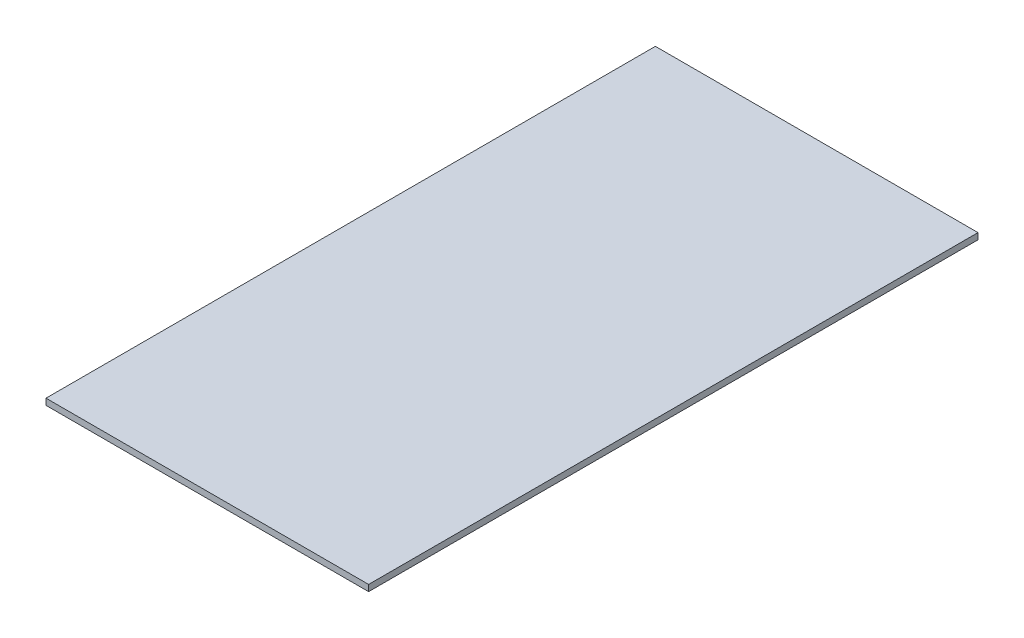
ISO-10303-21;
HEADER;
FILE_DESCRIPTION(('STEP AP214'),'2;1');
FILE_NAME('part.step','',(''),(''),'','','');
FILE_SCHEMA(('AUTOMOTIVE_DESIGN { 1 0 10303 214 1 1 1 1 }'));
ENDSEC;
DATA;
#1=APPLICATION_CONTEXT('core data for automotive mechanical design processes');
#2=APPLICATION_PROTOCOL_DEFINITION('international standard','automotive_design',2000,#1);
#3=PRODUCT_CONTEXT('',#1,'mechanical');
#4=PRODUCT('Part','Part','',(#3));
#5=PRODUCT_RELATED_PRODUCT_CATEGORY('part','',(#4));
#6=PRODUCT_DEFINITION_FORMATION('','',#4);
#7=PRODUCT_DEFINITION_CONTEXT('part definition',#1,'design');
#8=PRODUCT_DEFINITION('design','',#6,#7);
#9=PRODUCT_DEFINITION_SHAPE('','',#8);
#10=(LENGTH_UNIT() NAMED_UNIT(*) SI_UNIT(.MILLI.,.METRE.));
#11=(NAMED_UNIT(*) PLANE_ANGLE_UNIT() SI_UNIT($,.RADIAN.));
#12=(NAMED_UNIT(*) SI_UNIT($,.STERADIAN.) SOLID_ANGLE_UNIT());
#13=UNCERTAINTY_MEASURE_WITH_UNIT(LENGTH_MEASURE(1.E-05),#10,'distance_accuracy_value','');
#14=(GEOMETRIC_REPRESENTATION_CONTEXT(3) GLOBAL_UNCERTAINTY_ASSIGNED_CONTEXT((#13)) GLOBAL_UNIT_ASSIGNED_CONTEXT((#10,
#11,#12)) REPRESENTATION_CONTEXT('',''));
#15=CARTESIAN_POINT('',(0.,0.,0.));
#16=DIRECTION('',(0.,0.,1.));
#17=DIRECTION('',(1.,0.,0.));
#18=AXIS2_PLACEMENT_3D('',#15,#16,#17);
#19=CARTESIAN_POINT('',(-35.5322404371585,1.75,-109.622950819672));
#20=DIRECTION('',(1.,0.,0.));
#21=DIRECTION('',(0.,0.,-1.));
#22=AXIS2_PLACEMENT_3D('',#19,#20,#21);
#23=PLANE('',#22);
#24=DIRECTION('',(0.,0.,1.));
#25=VECTOR('',#24,1.);
#26=CARTESIAN_POINT('',(-35.5322404371585,0.,-109.622950819672));
#27=LINE('',#26,#25);
#28=CARTESIAN_POINT('',(-35.5322404371585,0.,-109.622950819672));
#29=VERTEX_POINT('',#28);
#30=CARTESIAN_POINT('',(-35.5322404371585,0.,60.3770491803279));
#31=VERTEX_POINT('',#30);
#32=EDGE_CURVE('E99',#29,#31,#27,.T.);
#33=ORIENTED_EDGE('',*,*,#32,.T.);
#34=DIRECTION('',(0.,-1.,0.));
#35=VECTOR('',#34,1.);
#36=CARTESIAN_POINT('',(-35.5322404371585,1.75,60.3770491803279));
#37=LINE('',#36,#35);
#38=CARTESIAN_POINT('',(-35.5322404371585,1.75,60.3770491803279));
#39=VERTEX_POINT('',#38);
#40=EDGE_CURVE('E11',#39,#31,#37,.T.);
#41=ORIENTED_EDGE('',*,*,#40,.F.);
#42=DIRECTION('',(0.,0.,1.));
#43=VECTOR('',#42,1.);
#44=CARTESIAN_POINT('',(-35.5322404371585,1.75,-109.622950819672));
#45=LINE('',#44,#43);
#46=CARTESIAN_POINT('',(-35.5322404371585,1.75,-109.622950819672));
#47=VERTEX_POINT('',#46);
#48=EDGE_CURVE('E87',#47,#39,#45,.T.);
#49=ORIENTED_EDGE('',*,*,#48,.F.);
#50=DIRECTION('',(0.,-1.,0.));
#51=VECTOR('',#50,1.);
#52=CARTESIAN_POINT('',(-35.5322404371585,1.75,-109.622950819672));
#53=LINE('',#52,#51);
#54=EDGE_CURVE('E95',#47,#29,#53,.T.);
#55=ORIENTED_EDGE('',*,*,#54,.T.);
#56=EDGE_LOOP('',(#33,#41,#49,#55));
#57=FACE_BOUND('',#56,.T.);
#58=ADVANCED_FACE('F36',(#57),#23,.F.);
#59=CARTESIAN_POINT('',(-35.5322404371585,1.75,60.3770491803279));
#60=DIRECTION('',(0.,0.,-1.));
#61=DIRECTION('',(-1.,0.,0.));
#62=AXIS2_PLACEMENT_3D('',#59,#60,#61);
#63=PLANE('',#62);
#64=DIRECTION('',(1.,0.,0.));
#65=VECTOR('',#64,1.);
#66=CARTESIAN_POINT('',(-35.5322404371585,0.,60.3770491803279));
#67=LINE('',#66,#65);
#68=CARTESIAN_POINT('',(54.4677595628415,0.,60.3770491803279));
#69=VERTEX_POINT('',#68);
#70=EDGE_CURVE('E91',#31,#69,#67,.T.);
#71=ORIENTED_EDGE('',*,*,#70,.T.);
#72=DIRECTION('',(0.,-1.,0.));
#73=VECTOR('',#72,1.);
#74=CARTESIAN_POINT('',(54.4677595628415,1.75,60.3770491803279));
#75=LINE('',#74,#73);
#76=CARTESIAN_POINT('',(54.4677595628415,1.75,60.3770491803279));
#77=VERTEX_POINT('',#76);
#78=EDGE_CURVE('E44',#77,#69,#75,.T.);
#79=ORIENTED_EDGE('',*,*,#78,.F.);
#80=DIRECTION('',(1.,0.,0.));
#81=VECTOR('',#80,1.);
#82=CARTESIAN_POINT('',(-35.5322404371585,1.75,60.3770491803279));
#83=LINE('',#82,#81);
#84=EDGE_CURVE('E82',#39,#77,#83,.T.);
#85=ORIENTED_EDGE('',*,*,#84,.F.);
#86=ORIENTED_EDGE('',*,*,#40,.T.);
#87=EDGE_LOOP('',(#71,#79,#85,#86));
#88=FACE_BOUND('',#87,.T.);
#89=ADVANCED_FACE('F90',(#88),#63,.F.);
#90=CARTESIAN_POINT('',(54.4677595628415,1.75,-109.622950819672));
#91=DIRECTION('',(-1.,0.,0.));
#92=DIRECTION('',(0.,0.,1.));
#93=AXIS2_PLACEMENT_3D('',#90,#91,#92);
#94=PLANE('',#93);
#95=DIRECTION('',(0.,0.,-1.));
#96=VECTOR('',#95,1.);
#97=CARTESIAN_POINT('',(54.4677595628415,0.,-109.622950819672));
#98=LINE('',#97,#96);
#99=CARTESIAN_POINT('',(54.4677595628415,0.,-109.622950819672));
#100=VERTEX_POINT('',#99);
#101=EDGE_CURVE('E69',#69,#100,#98,.T.);
#102=ORIENTED_EDGE('',*,*,#101,.T.);
#103=DIRECTION('',(0.,-1.,0.));
#104=VECTOR('',#103,1.);
#105=CARTESIAN_POINT('',(54.4677595628415,1.75,-109.622950819672));
#106=LINE('',#105,#104);
#107=CARTESIAN_POINT('',(54.4677595628415,1.75,-109.622950819672));
#108=VERTEX_POINT('',#107);
#109=EDGE_CURVE('E92',#108,#100,#106,.T.);
#110=ORIENTED_EDGE('',*,*,#109,.F.);
#111=DIRECTION('',(0.,0.,-1.));
#112=VECTOR('',#111,1.);
#113=CARTESIAN_POINT('',(54.4677595628415,1.75,-109.622950819672));
#114=LINE('',#113,#112);
#115=EDGE_CURVE('E85',#77,#108,#114,.T.);
#116=ORIENTED_EDGE('',*,*,#115,.F.);
#117=ORIENTED_EDGE('',*,*,#78,.T.);
#118=EDGE_LOOP('',(#102,#110,#116,#117));
#119=FACE_BOUND('',#118,.T.);
#120=ADVANCED_FACE('F93',(#119),#94,.F.);
#121=CARTESIAN_POINT('',(-35.5322404371585,1.75,-109.622950819672));
#122=DIRECTION('',(0.,0.,1.));
#123=DIRECTION('',(1.,0.,0.));
#124=AXIS2_PLACEMENT_3D('',#121,#122,#123);
#125=PLANE('',#124);
#126=DIRECTION('',(-1.,0.,0.));
#127=VECTOR('',#126,1.);
#128=CARTESIAN_POINT('',(-35.5322404371585,0.,-109.622950819672));
#129=LINE('',#128,#127);
#130=EDGE_CURVE('E75',#100,#29,#129,.T.);
#131=ORIENTED_EDGE('',*,*,#130,.T.);
#132=ORIENTED_EDGE('',*,*,#54,.F.);
#133=DIRECTION('',(-1.,0.,0.));
#134=VECTOR('',#133,1.);
#135=CARTESIAN_POINT('',(-35.5322404371585,1.75,-109.622950819672));
#136=LINE('',#135,#134);
#137=EDGE_CURVE('E52',#108,#47,#136,.T.);
#138=ORIENTED_EDGE('',*,*,#137,.F.);
#139=ORIENTED_EDGE('',*,*,#109,.T.);
#140=EDGE_LOOP('',(#131,#132,#138,#139));
#141=FACE_BOUND('',#140,.T.);
#142=ADVANCED_FACE('F106',(#141),#125,.F.);
#143=CARTESIAN_POINT('',(0.,1.75,0.));
#144=DIRECTION('',(0.,1.,0.));
#145=DIRECTION('',(0.,0.,1.));
#146=AXIS2_PLACEMENT_3D('',#143,#144,#145);
#147=PLANE('',#146);
#148=ORIENTED_EDGE('',*,*,#48,.T.);
#149=ORIENTED_EDGE('',*,*,#84,.T.);
#150=ORIENTED_EDGE('',*,*,#115,.T.);
#151=ORIENTED_EDGE('',*,*,#137,.T.);
#152=EDGE_LOOP('',(#148,#149,#150,#151));
#153=FACE_BOUND('',#152,.T.);
#154=ADVANCED_FACE('F83',(#153),#147,.T.);
#155=CARTESIAN_POINT('',(0.,0.,0.));
#156=DIRECTION('',(0.,1.,0.));
#157=DIRECTION('',(0.,0.,1.));
#158=AXIS2_PLACEMENT_3D('',#155,#156,#157);
#159=PLANE('',#158);
#160=ORIENTED_EDGE('',*,*,#32,.F.);
#161=ORIENTED_EDGE('',*,*,#130,.F.);
#162=ORIENTED_EDGE('',*,*,#101,.F.);
#163=ORIENTED_EDGE('',*,*,#70,.F.);
#164=EDGE_LOOP('',(#160,#161,#162,#163));
#165=FACE_BOUND('',#164,.T.);
#166=ADVANCED_FACE('F109',(#165),#159,.F.);
#167=CLOSED_SHELL('',(#58,#89,#120,#142,#154,#166));
#168=MANIFOLD_SOLID_BREP('B2',#167);
#169=ADVANCED_BREP_SHAPE_REPRESENTATION('',(#18,#168),#14);
#170=SHAPE_DEFINITION_REPRESENTATION(#9,#169);
ENDSEC;
END-ISO-10303-21;
